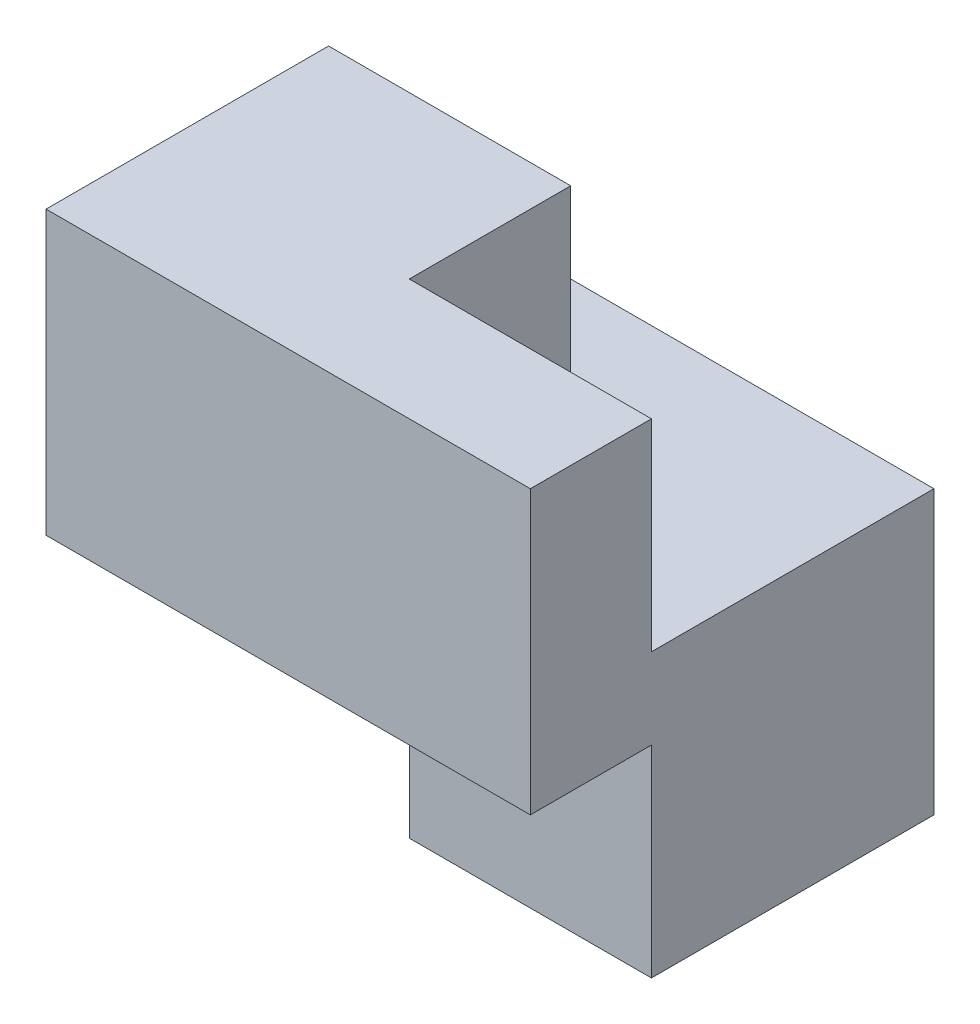
ISO-10303-21;
HEADER;
FILE_DESCRIPTION(('STEP AP214'),'2;1');
FILE_NAME('part.step','',(''),(''),'','','');
FILE_SCHEMA(('AUTOMOTIVE_DESIGN { 1 0 10303 214 1 1 1 1 }'));
ENDSEC;
DATA;
#1=APPLICATION_CONTEXT('core data for automotive mechanical design processes');
#2=APPLICATION_PROTOCOL_DEFINITION('international standard','automotive_design',2000,#1);
#3=PRODUCT_CONTEXT('',#1,'mechanical');
#4=PRODUCT('Part','Part','',(#3));
#5=PRODUCT_RELATED_PRODUCT_CATEGORY('part','',(#4));
#6=PRODUCT_DEFINITION_FORMATION('','',#4);
#7=PRODUCT_DEFINITION_CONTEXT('part definition',#1,'design');
#8=PRODUCT_DEFINITION('design','',#6,#7);
#9=PRODUCT_DEFINITION_SHAPE('','',#8);
#10=(LENGTH_UNIT() NAMED_UNIT(*) SI_UNIT(.MILLI.,.METRE.));
#11=(NAMED_UNIT(*) PLANE_ANGLE_UNIT() SI_UNIT($,.RADIAN.));
#12=(NAMED_UNIT(*) SI_UNIT($,.STERADIAN.) SOLID_ANGLE_UNIT());
#13=UNCERTAINTY_MEASURE_WITH_UNIT(LENGTH_MEASURE(1.E-05),#10,'distance_accuracy_value','');
#14=(GEOMETRIC_REPRESENTATION_CONTEXT(3) GLOBAL_UNCERTAINTY_ASSIGNED_CONTEXT((#13)) GLOBAL_UNIT_ASSIGNED_CONTEXT((#10,
#11,#12)) REPRESENTATION_CONTEXT('',''));
#15=CARTESIAN_POINT('',(0.,0.,0.));
#16=DIRECTION('',(0.,0.,1.));
#17=DIRECTION('',(1.,0.,0.));
#18=AXIS2_PLACEMENT_3D('',#15,#16,#17);
#19=CARTESIAN_POINT('',(3.,6.,2.5));
#20=DIRECTION('',(-1.,0.,0.));
#21=DIRECTION('',(0.,0.,1.));
#22=AXIS2_PLACEMENT_3D('',#19,#20,#21);
#23=PLANE('',#22);
#24=DIRECTION('',(0.,0.,1.));
#25=VECTOR('',#24,1.);
#26=CARTESIAN_POINT('',(3.,2.5,2.5));
#27=LINE('',#26,#25);
#28=CARTESIAN_POINT('',(3.,2.5,1.));
#29=VERTEX_POINT('',#28);
#30=CARTESIAN_POINT('',(3.,2.5,2.5));
#31=VERTEX_POINT('',#30);
#32=EDGE_CURVE('E123',#29,#31,#27,.T.);
#33=ORIENTED_EDGE('',*,*,#32,.F.);
#34=DIRECTION('',(0.,-1.,0.));
#35=VECTOR('',#34,1.);
#36=CARTESIAN_POINT('',(3.,2.5,1.));
#37=LINE('',#36,#35);
#38=CARTESIAN_POINT('',(3.,0.,1.));
#39=VERTEX_POINT('',#38);
#40=EDGE_CURVE('E212',#29,#39,#37,.T.);
#41=ORIENTED_EDGE('',*,*,#40,.T.);
#42=DIRECTION('',(0.,0.,-1.));
#43=VECTOR('',#42,1.);
#44=CARTESIAN_POINT('',(3.,0.,2.5));
#45=LINE('',#44,#43);
#46=CARTESIAN_POINT('',(3.,0.,-2.5));
#47=VERTEX_POINT('',#46);
#48=EDGE_CURVE('E177',#39,#47,#45,.T.);
#49=ORIENTED_EDGE('',*,*,#48,.T.);
#50=DIRECTION('',(0.,-1.,0.));
#51=VECTOR('',#50,1.);
#52=CARTESIAN_POINT('',(3.,6.,-2.5));
#53=LINE('',#52,#51);
#54=CARTESIAN_POINT('',(3.,3.5,-2.5));
#55=VERTEX_POINT('',#54);
#56=EDGE_CURVE('E11',#55,#47,#53,.T.);
#57=ORIENTED_EDGE('',*,*,#56,.F.);
#58=DIRECTION('',(0.,0.,-1.));
#59=VECTOR('',#58,1.);
#60=CARTESIAN_POINT('',(3.,3.5,0.));
#61=LINE('',#60,#59);
#62=CARTESIAN_POINT('',(3.,3.5,1.));
#63=VERTEX_POINT('',#62);
#64=EDGE_CURVE('E207',#63,#55,#61,.T.);
#65=ORIENTED_EDGE('',*,*,#64,.F.);
#66=DIRECTION('',(0.,1.,0.));
#67=VECTOR('',#66,1.);
#68=CARTESIAN_POINT('',(3.,3.5,1.));
#69=LINE('',#68,#67);
#70=CARTESIAN_POINT('',(3.,6.,1.));
#71=VERTEX_POINT('',#70);
#72=EDGE_CURVE('E191',#63,#71,#69,.T.);
#73=ORIENTED_EDGE('',*,*,#72,.T.);
#74=DIRECTION('',(0.,0.,-1.));
#75=VECTOR('',#74,1.);
#76=CARTESIAN_POINT('',(3.,6.,2.5));
#77=LINE('',#76,#75);
#78=CARTESIAN_POINT('',(3.,6.,2.5));
#79=VERTEX_POINT('',#78);
#80=EDGE_CURVE('E150',#79,#71,#77,.T.);
#81=ORIENTED_EDGE('',*,*,#80,.F.);
#82=DIRECTION('',(0.,-1.,0.));
#83=VECTOR('',#82,1.);
#84=CARTESIAN_POINT('',(3.,6.,2.5));
#85=LINE('',#84,#83);
#86=EDGE_CURVE('E142',#79,#31,#85,.T.);
#87=ORIENTED_EDGE('',*,*,#86,.T.);
#88=EDGE_LOOP('',(#33,#41,#49,#57,#65,#73,#81,#87));
#89=FACE_BOUND('',#88,.T.);
#90=ADVANCED_FACE('F33',(#89),#23,.F.);
#91=CARTESIAN_POINT('',(-3.,6.,-2.5));
#92=DIRECTION('',(0.,0.,1.));
#93=DIRECTION('',(1.,0.,0.));
#94=AXIS2_PLACEMENT_3D('',#91,#92,#93);
#95=PLANE('',#94);
#96=DIRECTION('',(-1.,0.,0.));
#97=VECTOR('',#96,1.);
#98=CARTESIAN_POINT('',(0.,3.5,-2.5));
#99=LINE('',#98,#97);
#100=CARTESIAN_POINT('',(-3.,3.5,-2.5));
#101=VERTEX_POINT('',#100);
#102=EDGE_CURVE('E203',#55,#101,#99,.T.);
#103=ORIENTED_EDGE('',*,*,#102,.F.);
#104=ORIENTED_EDGE('',*,*,#56,.T.);
#105=DIRECTION('',(-1.,0.,0.));
#106=VECTOR('',#105,1.);
#107=CARTESIAN_POINT('',(-3.,0.,-2.5));
#108=LINE('',#107,#106);
#109=CARTESIAN_POINT('',(-3.,0.,-2.5));
#110=VERTEX_POINT('',#109);
#111=EDGE_CURVE('E172',#47,#110,#108,.T.);
#112=ORIENTED_EDGE('',*,*,#111,.T.);
#113=DIRECTION('',(0.,-1.,0.));
#114=VECTOR('',#113,1.);
#115=CARTESIAN_POINT('',(-3.,6.,-2.5));
#116=LINE('',#115,#114);
#117=EDGE_CURVE('E40',#101,#110,#116,.T.);
#118=ORIENTED_EDGE('',*,*,#117,.F.);
#119=EDGE_LOOP('',(#103,#104,#112,#118));
#120=FACE_BOUND('',#119,.T.);
#121=ADVANCED_FACE('F173',(#120),#95,.F.);
#122=CARTESIAN_POINT('',(-3.,6.,2.5));
#123=DIRECTION('',(1.,0.,0.));
#124=DIRECTION('',(0.,0.,-1.));
#125=AXIS2_PLACEMENT_3D('',#122,#123,#124);
#126=PLANE('',#125);
#127=DIRECTION('',(0.,0.,1.));
#128=VECTOR('',#127,1.);
#129=CARTESIAN_POINT('',(-3.,0.,2.5));
#130=LINE('',#129,#128);
#131=CARTESIAN_POINT('',(-3.,0.,-1.));
#132=VERTEX_POINT('',#131);
#133=EDGE_CURVE('E157',#110,#132,#130,.T.);
#134=ORIENTED_EDGE('',*,*,#133,.T.);
#135=DIRECTION('',(0.,-1.,0.));
#136=VECTOR('',#135,1.);
#137=CARTESIAN_POINT('',(-3.,2.5,-1.));
#138=LINE('',#137,#136);
#139=CARTESIAN_POINT('',(-3.,2.5,-1.));
#140=VERTEX_POINT('',#139);
#141=EDGE_CURVE('E47',#140,#132,#138,.T.);
#142=ORIENTED_EDGE('',*,*,#141,.F.);
#143=DIRECTION('',(0.,0.,-1.));
#144=VECTOR('',#143,1.);
#145=CARTESIAN_POINT('',(-3.,2.5,-1.));
#146=LINE('',#145,#144);
#147=CARTESIAN_POINT('',(-3.,2.5,2.5));
#148=VERTEX_POINT('',#147);
#149=EDGE_CURVE('E146',#148,#140,#146,.T.);
#150=ORIENTED_EDGE('',*,*,#149,.F.);
#151=DIRECTION('',(0.,-1.,0.));
#152=VECTOR('',#151,1.);
#153=CARTESIAN_POINT('',(-3.,6.,2.5));
#154=LINE('',#153,#152);
#155=CARTESIAN_POINT('',(-3.,6.,2.5));
#156=VERTEX_POINT('',#155);
#157=EDGE_CURVE('E145',#156,#148,#154,.T.);
#158=ORIENTED_EDGE('',*,*,#157,.F.);
#159=DIRECTION('',(0.,0.,1.));
#160=VECTOR('',#159,1.);
#161=CARTESIAN_POINT('',(-3.,6.,2.5));
#162=LINE('',#161,#160);
#163=CARTESIAN_POINT('',(-3.,6.,-1.));
#164=VERTEX_POINT('',#163);
#165=EDGE_CURVE('E154',#164,#156,#162,.T.);
#166=ORIENTED_EDGE('',*,*,#165,.F.);
#167=DIRECTION('',(0.,1.,0.));
#168=VECTOR('',#167,1.);
#169=CARTESIAN_POINT('',(-3.,3.5,-1.));
#170=LINE('',#169,#168);
#171=CARTESIAN_POINT('',(-3.,3.5,-1.));
#172=VERTEX_POINT('',#171);
#173=EDGE_CURVE('E190',#172,#164,#170,.T.);
#174=ORIENTED_EDGE('',*,*,#173,.F.);
#175=DIRECTION('',(0.,0.,1.));
#176=VECTOR('',#175,1.);
#177=CARTESIAN_POINT('',(-3.,3.5,0.));
#178=LINE('',#177,#176);
#179=EDGE_CURVE('E168',#101,#172,#178,.T.);
#180=ORIENTED_EDGE('',*,*,#179,.F.);
#181=ORIENTED_EDGE('',*,*,#117,.T.);
#182=EDGE_LOOP('',(#134,#142,#150,#158,#166,#174,#180,#181));
#183=FACE_BOUND('',#182,.T.);
#184=ADVANCED_FACE('F164',(#183),#126,.F.);
#185=CARTESIAN_POINT('',(0.,6.,0.));
#186=DIRECTION('',(0.,-1.,0.));
#187=DIRECTION('',(0.,0.,-1.));
#188=AXIS2_PLACEMENT_3D('',#185,#186,#187);
#189=PLANE('',#188);
#190=DIRECTION('',(-1.,0.,0.));
#191=VECTOR('',#190,1.);
#192=CARTESIAN_POINT('',(0.,6.,-1.));
#193=LINE('',#192,#191);
#194=CARTESIAN_POINT('',(0.,6.,-1.));
#195=VERTEX_POINT('',#194);
#196=EDGE_CURVE('E55',#195,#164,#193,.T.);
#197=ORIENTED_EDGE('',*,*,#196,.T.);
#198=ORIENTED_EDGE('',*,*,#165,.T.);
#199=DIRECTION('',(1.,0.,0.));
#200=VECTOR('',#199,1.);
#201=CARTESIAN_POINT('',(-3.,6.,2.5));
#202=LINE('',#201,#200);
#203=EDGE_CURVE('E151',#156,#79,#202,.T.);
#204=ORIENTED_EDGE('',*,*,#203,.T.);
#205=ORIENTED_EDGE('',*,*,#80,.T.);
#206=DIRECTION('',(-1.,0.,0.));
#207=VECTOR('',#206,1.);
#208=CARTESIAN_POINT('',(0.,6.,1.));
#209=LINE('',#208,#207);
#210=CARTESIAN_POINT('',(0.,6.,1.));
#211=VERTEX_POINT('',#210);
#212=EDGE_CURVE('E196',#71,#211,#209,.T.);
#213=ORIENTED_EDGE('',*,*,#212,.T.);
#214=DIRECTION('',(0.,0.,-1.));
#215=VECTOR('',#214,1.);
#216=CARTESIAN_POINT('',(0.,6.,0.));
#217=LINE('',#216,#215);
#218=EDGE_CURVE('E211',#211,#195,#217,.T.);
#219=ORIENTED_EDGE('',*,*,#218,.T.);
#220=EDGE_LOOP('',(#197,#198,#204,#205,#213,#219));
#221=FACE_BOUND('',#220,.T.);
#222=ADVANCED_FACE('F245',(#221),#189,.F.);
#223=CARTESIAN_POINT('',(-3.,6.,2.5));
#224=DIRECTION('',(0.,0.,-1.));
#225=DIRECTION('',(-1.,0.,0.));
#226=AXIS2_PLACEMENT_3D('',#223,#224,#225);
#227=PLANE('',#226);
#228=ORIENTED_EDGE('',*,*,#157,.T.);
#229=DIRECTION('',(-1.,0.,0.));
#230=VECTOR('',#229,1.);
#231=CARTESIAN_POINT('',(-3.,2.5,2.5));
#232=LINE('',#231,#230);
#233=EDGE_CURVE('E127',#31,#148,#232,.T.);
#234=ORIENTED_EDGE('',*,*,#233,.F.);
#235=ORIENTED_EDGE('',*,*,#86,.F.);
#236=ORIENTED_EDGE('',*,*,#203,.F.);
#237=EDGE_LOOP('',(#228,#234,#235,#236));
#238=FACE_BOUND('',#237,.T.);
#239=ADVANCED_FACE('F140',(#238),#227,.F.);
#240=CARTESIAN_POINT('',(0.,0.,0.));
#241=DIRECTION('',(0.,-1.,0.));
#242=DIRECTION('',(0.,0.,-1.));
#243=AXIS2_PLACEMENT_3D('',#240,#241,#242);
#244=PLANE('',#243);
#245=DIRECTION('',(1.,0.,0.));
#246=VECTOR('',#245,1.);
#247=CARTESIAN_POINT('',(3.,0.,1.));
#248=LINE('',#247,#246);
#249=CARTESIAN_POINT('',(0.,0.,1.));
#250=VERTEX_POINT('',#249);
#251=EDGE_CURVE('E135',#250,#39,#248,.T.);
#252=ORIENTED_EDGE('',*,*,#251,.F.);
#253=DIRECTION('',(0.,0.,1.));
#254=VECTOR('',#253,1.);
#255=CARTESIAN_POINT('',(0.,0.,1.));
#256=LINE('',#255,#254);
#257=CARTESIAN_POINT('',(0.,0.,-1.));
#258=VERTEX_POINT('',#257);
#259=EDGE_CURVE('E262',#258,#250,#256,.T.);
#260=ORIENTED_EDGE('',*,*,#259,.F.);
#261=DIRECTION('',(1.,0.,0.));
#262=VECTOR('',#261,1.);
#263=CARTESIAN_POINT('',(0.,0.,-1.));
#264=LINE('',#263,#262);
#265=EDGE_CURVE('E181',#132,#258,#264,.T.);
#266=ORIENTED_EDGE('',*,*,#265,.F.);
#267=ORIENTED_EDGE('',*,*,#133,.F.);
#268=ORIENTED_EDGE('',*,*,#111,.F.);
#269=ORIENTED_EDGE('',*,*,#48,.F.);
#270=EDGE_LOOP('',(#252,#260,#266,#267,#268,#269));
#271=FACE_BOUND('',#270,.T.);
#272=ADVANCED_FACE('F179',(#271),#244,.T.);
#273=CARTESIAN_POINT('',(0.,3.5,-1.));
#274=DIRECTION('',(0.,0.,-1.));
#275=DIRECTION('',(-1.,0.,0.));
#276=AXIS2_PLACEMENT_3D('',#273,#274,#275);
#277=PLANE('',#276);
#278=ORIENTED_EDGE('',*,*,#196,.F.);
#279=DIRECTION('',(0.,1.,0.));
#280=VECTOR('',#279,1.);
#281=CARTESIAN_POINT('',(0.,3.5,-1.));
#282=LINE('',#281,#280);
#283=CARTESIAN_POINT('',(0.,3.5,-1.));
#284=VERTEX_POINT('',#283);
#285=EDGE_CURVE('E187',#284,#195,#282,.T.);
#286=ORIENTED_EDGE('',*,*,#285,.F.);
#287=DIRECTION('',(-1.,0.,0.));
#288=VECTOR('',#287,1.);
#289=CARTESIAN_POINT('',(0.,3.5,-1.));
#290=LINE('',#289,#288);
#291=EDGE_CURVE('E213',#284,#172,#290,.T.);
#292=ORIENTED_EDGE('',*,*,#291,.T.);
#293=ORIENTED_EDGE('',*,*,#173,.T.);
#294=EDGE_LOOP('',(#278,#286,#292,#293));
#295=FACE_BOUND('',#294,.T.);
#296=ADVANCED_FACE('F227',(#295),#277,.T.);
#297=CARTESIAN_POINT('',(0.,3.5,1.));
#298=DIRECTION('',(0.,0.,-1.));
#299=DIRECTION('',(-1.,0.,0.));
#300=AXIS2_PLACEMENT_3D('',#297,#298,#299);
#301=PLANE('',#300);
#302=ORIENTED_EDGE('',*,*,#212,.F.);
#303=ORIENTED_EDGE('',*,*,#72,.F.);
#304=DIRECTION('',(-1.,0.,0.));
#305=VECTOR('',#304,1.);
#306=CARTESIAN_POINT('',(0.,3.5,1.));
#307=LINE('',#306,#305);
#308=CARTESIAN_POINT('',(0.,3.5,1.));
#309=VERTEX_POINT('',#308);
#310=EDGE_CURVE('E216',#63,#309,#307,.T.);
#311=ORIENTED_EDGE('',*,*,#310,.T.);
#312=DIRECTION('',(0.,1.,0.));
#313=VECTOR('',#312,1.);
#314=CARTESIAN_POINT('',(0.,3.5,1.));
#315=LINE('',#314,#313);
#316=EDGE_CURVE('E193',#309,#211,#315,.T.);
#317=ORIENTED_EDGE('',*,*,#316,.T.);
#318=EDGE_LOOP('',(#302,#303,#311,#317));
#319=FACE_BOUND('',#318,.T.);
#320=ADVANCED_FACE('F225',(#319),#301,.T.);
#321=CARTESIAN_POINT('',(0.,3.5,0.));
#322=DIRECTION('',(1.,0.,0.));
#323=DIRECTION('',(0.,0.,-1.));
#324=AXIS2_PLACEMENT_3D('',#321,#322,#323);
#325=PLANE('',#324);
#326=ORIENTED_EDGE('',*,*,#218,.F.);
#327=ORIENTED_EDGE('',*,*,#316,.F.);
#328=DIRECTION('',(0.,0.,-1.));
#329=VECTOR('',#328,1.);
#330=CARTESIAN_POINT('',(0.,3.5,0.));
#331=LINE('',#330,#329);
#332=EDGE_CURVE('E214',#309,#284,#331,.T.);
#333=ORIENTED_EDGE('',*,*,#332,.T.);
#334=ORIENTED_EDGE('',*,*,#285,.T.);
#335=EDGE_LOOP('',(#326,#327,#333,#334));
#336=FACE_BOUND('',#335,.T.);
#337=ADVANCED_FACE('F226',(#336),#325,.T.);
#338=CARTESIAN_POINT('',(0.,3.5,0.));
#339=DIRECTION('',(0.,1.,0.));
#340=DIRECTION('',(0.,0.,1.));
#341=AXIS2_PLACEMENT_3D('',#338,#339,#340);
#342=PLANE('',#341);
#343=ORIENTED_EDGE('',*,*,#291,.F.);
#344=ORIENTED_EDGE('',*,*,#332,.F.);
#345=ORIENTED_EDGE('',*,*,#310,.F.);
#346=ORIENTED_EDGE('',*,*,#64,.T.);
#347=ORIENTED_EDGE('',*,*,#102,.T.);
#348=ORIENTED_EDGE('',*,*,#179,.T.);
#349=EDGE_LOOP('',(#343,#344,#345,#346,#347,#348));
#350=FACE_BOUND('',#349,.T.);
#351=ADVANCED_FACE('F223',(#350),#342,.T.);
#352=CARTESIAN_POINT('',(3.,2.5,1.));
#353=DIRECTION('',(0.,0.,-1.));
#354=DIRECTION('',(-1.,0.,0.));
#355=AXIS2_PLACEMENT_3D('',#352,#353,#354);
#356=PLANE('',#355);
#357=ORIENTED_EDGE('',*,*,#251,.T.);
#358=ORIENTED_EDGE('',*,*,#40,.F.);
#359=DIRECTION('',(1.,0.,0.));
#360=VECTOR('',#359,1.);
#361=CARTESIAN_POINT('',(3.,2.5,1.));
#362=LINE('',#361,#360);
#363=CARTESIAN_POINT('',(0.,2.5,1.));
#364=VERTEX_POINT('',#363);
#365=EDGE_CURVE('E131',#364,#29,#362,.T.);
#366=ORIENTED_EDGE('',*,*,#365,.F.);
#367=DIRECTION('',(0.,-1.,0.));
#368=VECTOR('',#367,1.);
#369=CARTESIAN_POINT('',(0.,2.5,1.));
#370=LINE('',#369,#368);
#371=EDGE_CURVE('E267',#364,#250,#370,.T.);
#372=ORIENTED_EDGE('',*,*,#371,.T.);
#373=EDGE_LOOP('',(#357,#358,#366,#372));
#374=FACE_BOUND('',#373,.T.);
#375=ADVANCED_FACE('F274',(#374),#356,.F.);
#376=CARTESIAN_POINT('',(0.,2.5,1.));
#377=DIRECTION('',(1.,0.,0.));
#378=DIRECTION('',(0.,0.,-1.));
#379=AXIS2_PLACEMENT_3D('',#376,#377,#378);
#380=PLANE('',#379);
#381=ORIENTED_EDGE('',*,*,#259,.T.);
#382=ORIENTED_EDGE('',*,*,#371,.F.);
#383=DIRECTION('',(0.,0.,1.));
#384=VECTOR('',#383,1.);
#385=CARTESIAN_POINT('',(0.,2.5,1.));
#386=LINE('',#385,#384);
#387=CARTESIAN_POINT('',(0.,2.5,-1.));
#388=VERTEX_POINT('',#387);
#389=EDGE_CURVE('E256',#388,#364,#386,.T.);
#390=ORIENTED_EDGE('',*,*,#389,.F.);
#391=DIRECTION('',(0.,-1.,0.));
#392=VECTOR('',#391,1.);
#393=CARTESIAN_POINT('',(0.,2.5,-1.));
#394=LINE('',#393,#392);
#395=EDGE_CURVE('E268',#388,#258,#394,.T.);
#396=ORIENTED_EDGE('',*,*,#395,.T.);
#397=EDGE_LOOP('',(#381,#382,#390,#396));
#398=FACE_BOUND('',#397,.T.);
#399=ADVANCED_FACE('F271',(#398),#380,.F.);
#400=CARTESIAN_POINT('',(0.,2.5,-1.));
#401=DIRECTION('',(0.,0.,-1.));
#402=DIRECTION('',(-1.,0.,0.));
#403=AXIS2_PLACEMENT_3D('',#400,#401,#402);
#404=PLANE('',#403);
#405=ORIENTED_EDGE('',*,*,#265,.T.);
#406=ORIENTED_EDGE('',*,*,#395,.F.);
#407=DIRECTION('',(1.,0.,0.));
#408=VECTOR('',#407,1.);
#409=CARTESIAN_POINT('',(0.,2.5,-1.));
#410=LINE('',#409,#408);
#411=EDGE_CURVE('E254',#140,#388,#410,.T.);
#412=ORIENTED_EDGE('',*,*,#411,.F.);
#413=ORIENTED_EDGE('',*,*,#141,.T.);
#414=EDGE_LOOP('',(#405,#406,#412,#413));
#415=FACE_BOUND('',#414,.T.);
#416=ADVANCED_FACE('F272',(#415),#404,.F.);
#417=CARTESIAN_POINT('',(0.,2.5,0.));
#418=DIRECTION('',(0.,1.,0.));
#419=DIRECTION('',(0.,0.,1.));
#420=AXIS2_PLACEMENT_3D('',#417,#418,#419);
#421=PLANE('',#420);
#422=ORIENTED_EDGE('',*,*,#32,.T.);
#423=ORIENTED_EDGE('',*,*,#233,.T.);
#424=ORIENTED_EDGE('',*,*,#149,.T.);
#425=ORIENTED_EDGE('',*,*,#411,.T.);
#426=ORIENTED_EDGE('',*,*,#389,.T.);
#427=ORIENTED_EDGE('',*,*,#365,.T.);
#428=EDGE_LOOP('',(#422,#423,#424,#425,#426,#427));
#429=FACE_BOUND('',#428,.T.);
#430=ADVANCED_FACE('F125',(#429),#421,.F.);
#431=CLOSED_SHELL('',(#90,#121,#184,#222,#239,#272,#296,#320,#337,#351,#375,#399,#416,#430));
#432=MANIFOLD_SOLID_BREP('B2',#431);
#433=ADVANCED_BREP_SHAPE_REPRESENTATION('',(#18,#432),#14);
#434=SHAPE_DEFINITION_REPRESENTATION(#9,#433);
ENDSEC;
END-ISO-10303-21;
